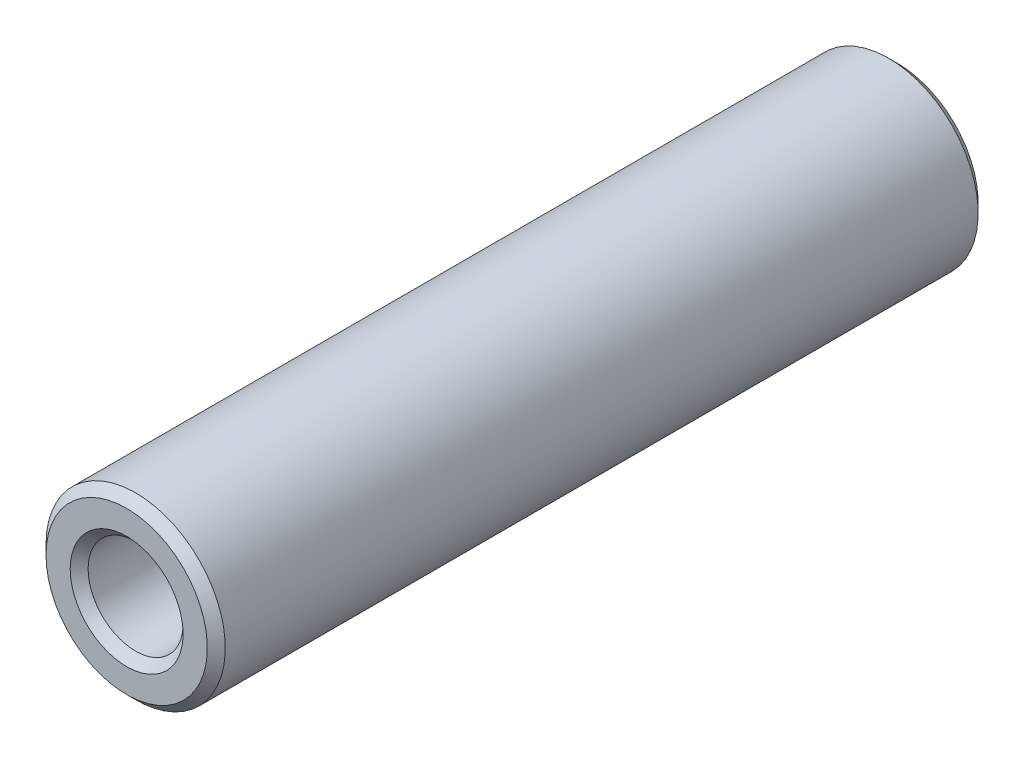
ISO-10303-21;
HEADER;
FILE_DESCRIPTION(('STEP AP214'),'2;1');
FILE_NAME('part.step','',(''),(''),'','','');
FILE_SCHEMA(('AUTOMOTIVE_DESIGN { 1 0 10303 214 1 1 1 1 }'));
ENDSEC;
DATA;
#1=APPLICATION_CONTEXT('core data for automotive mechanical design processes');
#2=APPLICATION_PROTOCOL_DEFINITION('international standard','automotive_design',2000,#1);
#3=PRODUCT_CONTEXT('',#1,'mechanical');
#4=PRODUCT('Part','Part','',(#3));
#5=PRODUCT_RELATED_PRODUCT_CATEGORY('part','',(#4));
#6=PRODUCT_DEFINITION_FORMATION('','',#4);
#7=PRODUCT_DEFINITION_CONTEXT('part definition',#1,'design');
#8=PRODUCT_DEFINITION('design','',#6,#7);
#9=PRODUCT_DEFINITION_SHAPE('','',#8);
#10=(LENGTH_UNIT() NAMED_UNIT(*) SI_UNIT(.MILLI.,.METRE.));
#11=(NAMED_UNIT(*) PLANE_ANGLE_UNIT() SI_UNIT($,.RADIAN.));
#12=(NAMED_UNIT(*) SI_UNIT($,.STERADIAN.) SOLID_ANGLE_UNIT());
#13=UNCERTAINTY_MEASURE_WITH_UNIT(LENGTH_MEASURE(1.E-05),#10,'distance_accuracy_value','');
#14=(GEOMETRIC_REPRESENTATION_CONTEXT(3) GLOBAL_UNCERTAINTY_ASSIGNED_CONTEXT((#13)) GLOBAL_UNIT_ASSIGNED_CONTEXT((#10,
#11,#12)) REPRESENTATION_CONTEXT('',''));
#15=CARTESIAN_POINT('',(0.,0.,0.));
#16=DIRECTION('',(0.,0.,1.));
#17=DIRECTION('',(1.,0.,0.));
#18=AXIS2_PLACEMENT_3D('',#15,#16,#17);
#19=CARTESIAN_POINT('',(0.,0.,13.));
#20=DIRECTION('',(0.,0.,-1.));
#21=DIRECTION('',(-1.,0.,0.));
#22=AXIS2_PLACEMENT_3D('',#19,#20,#21);
#23=PLANE('',#22);
#24=CARTESIAN_POINT('',(0.,0.,13.));
#25=DIRECTION('',(0.,0.,-1.));
#26=DIRECTION('',(-1.,0.,0.));
#27=AXIS2_PLACEMENT_3D('',#24,#25,#26);
#28=CIRCLE('',#27,4.5);
#29=CARTESIAN_POINT('',(-4.5,0.,13.));
#30=VERTEX_POINT('',#29);
#31=EDGE_CURVE('E13',#30,#30,#28,.F.);
#32=ORIENTED_EDGE('',*,*,#31,.T.);
#33=EDGE_LOOP('',(#32));
#34=FACE_BOUND('',#33,.T.);
#35=CARTESIAN_POINT('',(0.,0.,13.));
#36=DIRECTION('',(0.,0.,-1.));
#37=DIRECTION('',(-1.,0.,0.));
#38=AXIS2_PLACEMENT_3D('',#35,#36,#37);
#39=CIRCLE('',#38,3.15000000000001);
#40=CARTESIAN_POINT('',(-3.15000000000001,0.,13.));
#41=VERTEX_POINT('',#40);
#42=EDGE_CURVE('E150',#41,#41,#39,.T.);
#43=ORIENTED_EDGE('',*,*,#42,.T.);
#44=EDGE_LOOP('',(#43));
#45=FACE_BOUND('',#44,.T.);
#46=ADVANCED_FACE('F60',(#34,#45),#23,.F.);
#47=CARTESIAN_POINT('',(0.,0.,6.));
#48=DIRECTION('',(0.,0.,1.));
#49=DIRECTION('',(1.,0.,0.));
#50=AXIS2_PLACEMENT_3D('',#47,#48,#49);
#51=PLANE('',#50);
#52=DIRECTION('',(-1.,0.,0.));
#53=VECTOR('',#52,1.);
#54=CARTESIAN_POINT('',(-1.54919333848297,2.15,6.));
#55=LINE('',#54,#53);
#56=CARTESIAN_POINT('',(1.54919333848297,2.15,6.));
#57=VERTEX_POINT('',#56);
#58=CARTESIAN_POINT('',(-1.54919333848297,2.15,6.));
#59=VERTEX_POINT('',#58);
#60=EDGE_CURVE('E133',#57,#59,#55,.T.);
#61=ORIENTED_EDGE('',*,*,#60,.F.);
#62=CARTESIAN_POINT('',(0.,0.,6.));
#63=DIRECTION('',(0.,0.,1.));
#64=DIRECTION('',(1.,0.,0.));
#65=AXIS2_PLACEMENT_3D('',#62,#63,#64);
#66=CIRCLE('',#65,2.65);
#67=EDGE_CURVE('E85',#57,#59,#66,.T.);
#68=ORIENTED_EDGE('',*,*,#67,.T.);
#69=EDGE_LOOP('',(#61,#68));
#70=FACE_BOUND('',#69,.T.);
#71=ADVANCED_FACE('F198',(#70),#51,.T.);
#72=CARTESIAN_POINT('',(0.,0.,6.));
#73=DIRECTION('',(0.,0.,-1.));
#74=DIRECTION('',(-1.,0.,0.));
#75=AXIS2_PLACEMENT_3D('',#72,#73,#74);
#76=CYLINDRICAL_SURFACE('',#75,2.65);
#77=CARTESIAN_POINT('',(0.,0.,12.5));
#78=DIRECTION('',(0.,0.,-1.));
#79=DIRECTION('',(-1.,0.,0.));
#80=AXIS2_PLACEMENT_3D('',#77,#78,#79);
#81=CIRCLE('',#80,2.65);
#82=CARTESIAN_POINT('',(-2.65,0.,12.5));
#83=VERTEX_POINT('',#82);
#84=EDGE_CURVE('E154',#83,#83,#81,.F.);
#85=ORIENTED_EDGE('',*,*,#84,.T.);
#86=EDGE_LOOP('',(#85));
#87=FACE_BOUND('',#86,.T.);
#88=CARTESIAN_POINT('',(0.,0.,0.));
#89=DIRECTION('',(0.,0.,1.));
#90=DIRECTION('',(1.,0.,0.));
#91=AXIS2_PLACEMENT_3D('',#88,#89,#90);
#92=CIRCLE('',#91,2.65);
#93=CARTESIAN_POINT('',(-1.54919333848297,2.15,0.));
#94=VERTEX_POINT('',#93);
#95=CARTESIAN_POINT('',(1.54919333848297,2.15,0.));
#96=VERTEX_POINT('',#95);
#97=EDGE_CURVE('E132',#94,#96,#92,.T.);
#98=ORIENTED_EDGE('',*,*,#97,.F.);
#99=DIRECTION('',(0.,0.,-1.));
#100=VECTOR('',#99,1.);
#101=CARTESIAN_POINT('',(-1.54919333848297,2.15,6.));
#102=LINE('',#101,#100);
#103=EDGE_CURVE('E137',#59,#94,#102,.T.);
#104=ORIENTED_EDGE('',*,*,#103,.F.);
#105=ORIENTED_EDGE('',*,*,#67,.F.);
#106=DIRECTION('',(0.,0.,-1.));
#107=VECTOR('',#106,1.);
#108=CARTESIAN_POINT('',(1.54919333848297,2.15,6.));
#109=LINE('',#108,#107);
#110=EDGE_CURVE('E147',#57,#96,#109,.T.);
#111=ORIENTED_EDGE('',*,*,#110,.T.);
#112=EDGE_LOOP('',(#98,#104,#105,#111));
#113=FACE_BOUND('',#112,.T.);
#114=ADVANCED_FACE('F251',(#87,#113),#76,.F.);
#115=CARTESIAN_POINT('',(-1.54919333848297,2.15,6.));
#116=DIRECTION('',(0.,-1.,0.));
#117=DIRECTION('',(0.,0.,-1.));
#118=AXIS2_PLACEMENT_3D('',#115,#116,#117);
#119=PLANE('',#118);
#120=DIRECTION('',(-1.,0.,0.));
#121=VECTOR('',#120,1.);
#122=CARTESIAN_POINT('',(-1.54919333848297,2.15,0.));
#123=LINE('',#122,#121);
#124=EDGE_CURVE('E138',#96,#94,#123,.T.);
#125=ORIENTED_EDGE('',*,*,#124,.F.);
#126=ORIENTED_EDGE('',*,*,#110,.F.);
#127=ORIENTED_EDGE('',*,*,#60,.T.);
#128=ORIENTED_EDGE('',*,*,#103,.T.);
#129=EDGE_LOOP('',(#125,#126,#127,#128));
#130=FACE_BOUND('',#129,.T.);
#131=ADVANCED_FACE('F211',(#130),#119,.T.);
#132=CARTESIAN_POINT('',(0.,0.,0.));
#133=DIRECTION('',(0.,0.,-1.));
#134=DIRECTION('',(-1.,0.,0.));
#135=AXIS2_PLACEMENT_3D('',#132,#133,#134);
#136=PLANE('',#135);
#137=ORIENTED_EDGE('',*,*,#124,.T.);
#138=ORIENTED_EDGE('',*,*,#97,.T.);
#139=EDGE_LOOP('',(#137,#138));
#140=FACE_BOUND('',#139,.T.);
#141=ADVANCED_FACE('F203',(#140),#136,.F.);
#142=CARTESIAN_POINT('',(0.,0.,13.));
#143=DIRECTION('',(0.,0.,1.));
#144=DIRECTION('',(1.,0.,0.));
#145=AXIS2_PLACEMENT_3D('',#142,#143,#144);
#146=CONICAL_SURFACE('',#145,3.15000000000001,0.785398163397451);
#147=ORIENTED_EDGE('',*,*,#84,.F.);
#148=EDGE_LOOP('',(#147));
#149=FACE_BOUND('',#148,.T.);
#150=ORIENTED_EDGE('',*,*,#42,.F.);
#151=EDGE_LOOP('',(#150));
#152=FACE_BOUND('',#151,.T.);
#153=ADVANCED_FACE('F188',(#149,#152),#146,.F.);
#154=CARTESIAN_POINT('',(0.,0.,-30.));
#155=DIRECTION('',(0.,0.,1.));
#156=DIRECTION('',(1.,0.,0.));
#157=AXIS2_PLACEMENT_3D('',#154,#155,#156);
#158=CYLINDRICAL_SURFACE('',#157,5.);
#159=CARTESIAN_POINT('',(0.,0.,-29.5));
#160=DIRECTION('',(0.,0.,-1.));
#161=DIRECTION('',(-1.,0.,0.));
#162=AXIS2_PLACEMENT_3D('',#159,#160,#161);
#163=CIRCLE('',#162,5.);
#164=CARTESIAN_POINT('',(-5.,0.,-29.5));
#165=VERTEX_POINT('',#164);
#166=EDGE_CURVE('E170',#165,#165,#163,.F.);
#167=ORIENTED_EDGE('',*,*,#166,.T.);
#168=EDGE_LOOP('',(#167));
#169=FACE_BOUND('',#168,.T.);
#170=CARTESIAN_POINT('',(0.,0.,12.5));
#171=DIRECTION('',(0.,0.,-1.));
#172=DIRECTION('',(-1.,0.,0.));
#173=AXIS2_PLACEMENT_3D('',#170,#171,#172);
#174=CIRCLE('',#173,5.);
#175=CARTESIAN_POINT('',(-5.,0.,12.5));
#176=VERTEX_POINT('',#175);
#177=EDGE_CURVE('E166',#176,#176,#174,.T.);
#178=ORIENTED_EDGE('',*,*,#177,.T.);
#179=EDGE_LOOP('',(#178));
#180=FACE_BOUND('',#179,.T.);
#181=ADVANCED_FACE('F185',(#169,#180),#158,.T.);
#182=CARTESIAN_POINT('',(0.,0.,-15.));
#183=DIRECTION('',(0.,0.,-1.));
#184=DIRECTION('',(-1.,0.,0.));
#185=AXIS2_PLACEMENT_3D('',#182,#183,#184);
#186=PLANE('',#185);
#187=DIRECTION('',(-1.,0.,0.));
#188=VECTOR('',#187,1.);
#189=CARTESIAN_POINT('',(0.,2.15,-15.));
#190=LINE('',#189,#188);
#191=CARTESIAN_POINT('',(1.54919333848297,2.15,-15.));
#192=VERTEX_POINT('',#191);
#193=CARTESIAN_POINT('',(-1.54919333848297,2.15,-15.));
#194=VERTEX_POINT('',#193);
#195=EDGE_CURVE('E105',#192,#194,#190,.T.);
#196=ORIENTED_EDGE('',*,*,#195,.F.);
#197=CARTESIAN_POINT('',(0.,0.,-15.));
#198=DIRECTION('',(0.,0.,-1.));
#199=DIRECTION('',(-1.,0.,0.));
#200=AXIS2_PLACEMENT_3D('',#197,#198,#199);
#201=CIRCLE('',#200,2.65);
#202=EDGE_CURVE('E112',#192,#194,#201,.T.);
#203=ORIENTED_EDGE('',*,*,#202,.T.);
#204=EDGE_LOOP('',(#196,#203));
#205=FACE_BOUND('',#204,.T.);
#206=ADVANCED_FACE('F116',(#205),#186,.T.);
#207=CARTESIAN_POINT('',(0.,2.15,-15.));
#208=DIRECTION('',(0.,-1.,0.));
#209=DIRECTION('',(0.,0.,-1.));
#210=AXIS2_PLACEMENT_3D('',#207,#208,#209);
#211=PLANE('',#210);
#212=DIRECTION('',(-1.,0.,0.));
#213=VECTOR('',#212,1.);
#214=CARTESIAN_POINT('',(0.,2.15,-21.));
#215=LINE('',#214,#213);
#216=CARTESIAN_POINT('',(1.54919333848297,2.15,-21.));
#217=VERTEX_POINT('',#216);
#218=CARTESIAN_POINT('',(-1.54919333848297,2.15,-21.));
#219=VERTEX_POINT('',#218);
#220=EDGE_CURVE('E106',#217,#219,#215,.T.);
#221=ORIENTED_EDGE('',*,*,#220,.F.);
#222=DIRECTION('',(0.,0.,-1.));
#223=VECTOR('',#222,1.);
#224=CARTESIAN_POINT('',(1.54919333848297,2.15,-15.));
#225=LINE('',#224,#223);
#226=EDGE_CURVE('E102',#192,#217,#225,.T.);
#227=ORIENTED_EDGE('',*,*,#226,.F.);
#228=ORIENTED_EDGE('',*,*,#195,.T.);
#229=DIRECTION('',(0.,0.,-1.));
#230=VECTOR('',#229,1.);
#231=CARTESIAN_POINT('',(-1.54919333848297,2.15,-15.));
#232=LINE('',#231,#230);
#233=EDGE_CURVE('E77',#194,#219,#232,.T.);
#234=ORIENTED_EDGE('',*,*,#233,.T.);
#235=EDGE_LOOP('',(#221,#227,#228,#234));
#236=FACE_BOUND('',#235,.T.);
#237=ADVANCED_FACE('F104',(#236),#211,.T.);
#238=CARTESIAN_POINT('',(0.,0.,-21.));
#239=DIRECTION('',(0.,0.,-1.));
#240=DIRECTION('',(-1.,0.,0.));
#241=AXIS2_PLACEMENT_3D('',#238,#239,#240);
#242=PLANE('',#241);
#243=CARTESIAN_POINT('',(0.,0.,-21.));
#244=DIRECTION('',(0.,0.,-1.));
#245=DIRECTION('',(-1.,0.,0.));
#246=AXIS2_PLACEMENT_3D('',#243,#244,#245);
#247=CIRCLE('',#246,2.65);
#248=EDGE_CURVE('E126',#219,#217,#247,.T.);
#249=ORIENTED_EDGE('',*,*,#248,.T.);
#250=ORIENTED_EDGE('',*,*,#220,.T.);
#251=EDGE_LOOP('',(#249,#250));
#252=FACE_BOUND('',#251,.T.);
#253=ADVANCED_FACE('F237',(#252),#242,.T.);
#254=CARTESIAN_POINT('',(0.,0.,-21.));
#255=DIRECTION('',(0.,0.,-1.));
#256=DIRECTION('',(-1.,0.,0.));
#257=AXIS2_PLACEMENT_3D('',#254,#255,#256);
#258=CYLINDRICAL_SURFACE('',#257,2.65);
#259=CARTESIAN_POINT('',(0.,0.,-29.5));
#260=DIRECTION('',(0.,0.,-1.));
#261=DIRECTION('',(-1.,0.,0.));
#262=AXIS2_PLACEMENT_3D('',#259,#260,#261);
#263=CIRCLE('',#262,2.65);
#264=CARTESIAN_POINT('',(-2.65,0.,-29.5));
#265=VERTEX_POINT('',#264);
#266=EDGE_CURVE('E162',#265,#265,#263,.T.);
#267=ORIENTED_EDGE('',*,*,#266,.T.);
#268=EDGE_LOOP('',(#267));
#269=FACE_BOUND('',#268,.T.);
#270=ORIENTED_EDGE('',*,*,#248,.F.);
#271=ORIENTED_EDGE('',*,*,#233,.F.);
#272=ORIENTED_EDGE('',*,*,#202,.F.);
#273=ORIENTED_EDGE('',*,*,#226,.T.);
#274=EDGE_LOOP('',(#270,#271,#272,#273));
#275=FACE_BOUND('',#274,.T.);
#276=ADVANCED_FACE('F119',(#269,#275),#258,.F.);
#277=CARTESIAN_POINT('',(0.,0.,-29.5));
#278=DIRECTION('',(0.,0.,-1.));
#279=DIRECTION('',(-1.,0.,0.));
#280=AXIS2_PLACEMENT_3D('',#277,#278,#279);
#281=CONICAL_SURFACE('',#280,2.65,0.785398163397448);
#282=CARTESIAN_POINT('',(0.,0.,-30.));
#283=DIRECTION('',(0.,0.,-1.));
#284=DIRECTION('',(-1.,0.,0.));
#285=AXIS2_PLACEMENT_3D('',#282,#283,#284);
#286=CIRCLE('',#285,3.15);
#287=CARTESIAN_POINT('',(-3.15,0.,-30.));
#288=VERTEX_POINT('',#287);
#289=EDGE_CURVE('E158',#288,#288,#286,.F.);
#290=ORIENTED_EDGE('',*,*,#289,.F.);
#291=EDGE_LOOP('',(#290));
#292=FACE_BOUND('',#291,.T.);
#293=ORIENTED_EDGE('',*,*,#266,.F.);
#294=EDGE_LOOP('',(#293));
#295=FACE_BOUND('',#294,.T.);
#296=ADVANCED_FACE('F222',(#292,#295),#281,.F.);
#297=CARTESIAN_POINT('',(0.,0.,-30.));
#298=DIRECTION('',(0.,0.,-1.));
#299=DIRECTION('',(-1.,0.,0.));
#300=AXIS2_PLACEMENT_3D('',#297,#298,#299);
#301=PLANE('',#300);
#302=CARTESIAN_POINT('',(0.,0.,-30.));
#303=DIRECTION('',(0.,0.,-1.));
#304=DIRECTION('',(-1.,0.,0.));
#305=AXIS2_PLACEMENT_3D('',#302,#303,#304);
#306=CIRCLE('',#305,4.50000000000001);
#307=CARTESIAN_POINT('',(-4.50000000000001,0.,-30.));
#308=VERTEX_POINT('',#307);
#309=EDGE_CURVE('E70',#308,#308,#306,.T.);
#310=ORIENTED_EDGE('',*,*,#309,.T.);
#311=EDGE_LOOP('',(#310));
#312=FACE_BOUND('',#311,.T.);
#313=ORIENTED_EDGE('',*,*,#289,.T.);
#314=EDGE_LOOP('',(#313));
#315=FACE_BOUND('',#314,.T.);
#316=ADVANCED_FACE('F177',(#312,#315),#301,.T.);
#317=CARTESIAN_POINT('',(0.,0.,-29.5));
#318=DIRECTION('',(0.,0.,1.));
#319=DIRECTION('',(1.,0.,0.));
#320=AXIS2_PLACEMENT_3D('',#317,#318,#319);
#321=CONICAL_SURFACE('',#320,5.,0.785398163397454);
#322=ORIENTED_EDGE('',*,*,#309,.F.);
#323=EDGE_LOOP('',(#322));
#324=FACE_BOUND('',#323,.T.);
#325=ORIENTED_EDGE('',*,*,#166,.F.);
#326=EDGE_LOOP('',(#325));
#327=FACE_BOUND('',#326,.T.);
#328=ADVANCED_FACE('F180',(#324,#327),#321,.T.);
#329=CARTESIAN_POINT('',(0.,0.,13.));
#330=DIRECTION('',(0.,0.,-1.));
#331=DIRECTION('',(-1.,0.,0.));
#332=AXIS2_PLACEMENT_3D('',#329,#330,#331);
#333=CONICAL_SURFACE('',#332,4.5,0.785398163397444);
#334=ORIENTED_EDGE('',*,*,#177,.F.);
#335=EDGE_LOOP('',(#334));
#336=FACE_BOUND('',#335,.T.);
#337=ORIENTED_EDGE('',*,*,#31,.F.);
#338=EDGE_LOOP('',(#337));
#339=FACE_BOUND('',#338,.T.);
#340=ADVANCED_FACE('F63',(#336,#339),#333,.T.);
#341=CLOSED_SHELL('',(#46,#71,#114,#131,#141,#153,#181,#206,#237,#253,#276,#296,#316,#328,#340));
#342=MANIFOLD_SOLID_BREP('B2',#341);
#343=ADVANCED_BREP_SHAPE_REPRESENTATION('',(#18,#342),#14);
#344=SHAPE_DEFINITION_REPRESENTATION(#9,#343);
ENDSEC;
END-ISO-10303-21;
